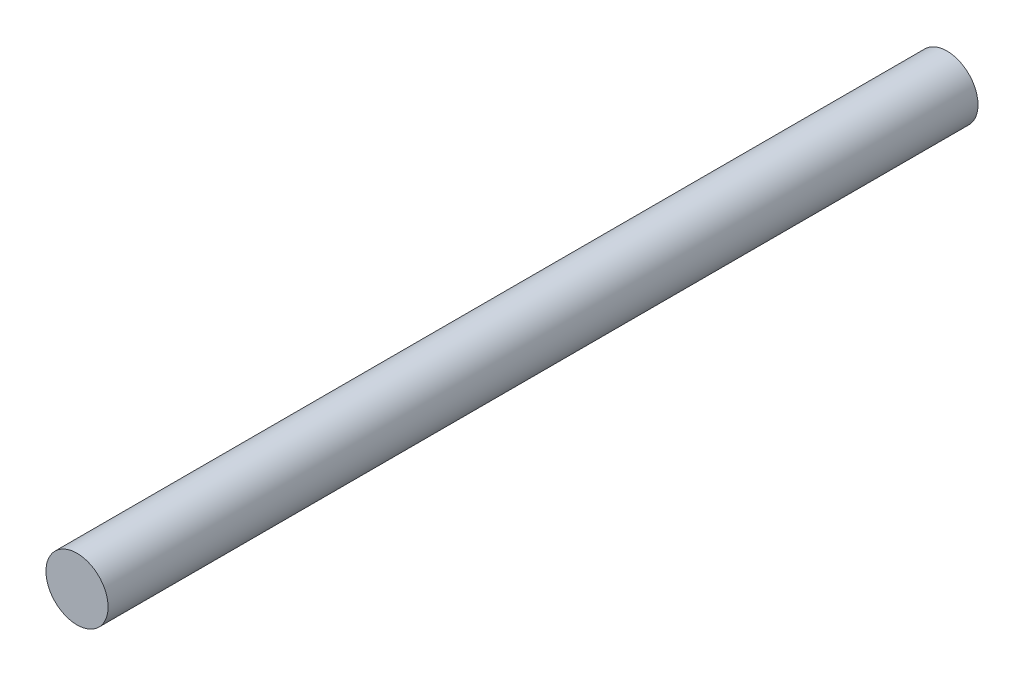
ISO-10303-21;
HEADER;
FILE_DESCRIPTION(('STEP AP214'),'2;1');
FILE_NAME('part.step','',(''),(''),'','','');
FILE_SCHEMA(('AUTOMOTIVE_DESIGN { 1 0 10303 214 1 1 1 1 }'));
ENDSEC;
DATA;
#1=APPLICATION_CONTEXT('core data for automotive mechanical design processes');
#2=APPLICATION_PROTOCOL_DEFINITION('international standard','automotive_design',2000,#1);
#3=PRODUCT_CONTEXT('',#1,'mechanical');
#4=PRODUCT('Part','Part','',(#3));
#5=PRODUCT_RELATED_PRODUCT_CATEGORY('part','',(#4));
#6=PRODUCT_DEFINITION_FORMATION('','',#4);
#7=PRODUCT_DEFINITION_CONTEXT('part definition',#1,'design');
#8=PRODUCT_DEFINITION('design','',#6,#7);
#9=PRODUCT_DEFINITION_SHAPE('','',#8);
#10=(LENGTH_UNIT() NAMED_UNIT(*) SI_UNIT(.MILLI.,.METRE.));
#11=(NAMED_UNIT(*) PLANE_ANGLE_UNIT() SI_UNIT($,.RADIAN.));
#12=(NAMED_UNIT(*) SI_UNIT($,.STERADIAN.) SOLID_ANGLE_UNIT());
#13=UNCERTAINTY_MEASURE_WITH_UNIT(LENGTH_MEASURE(1.E-05),#10,'distance_accuracy_value','');
#14=(GEOMETRIC_REPRESENTATION_CONTEXT(3) GLOBAL_UNCERTAINTY_ASSIGNED_CONTEXT((#13)) GLOBAL_UNIT_ASSIGNED_CONTEXT((#10,
#11,#12)) REPRESENTATION_CONTEXT('',''));
#15=CARTESIAN_POINT('',(0.,0.,0.));
#16=DIRECTION('',(0.,0.,1.));
#17=DIRECTION('',(1.,0.,0.));
#18=AXIS2_PLACEMENT_3D('',#15,#16,#17);
#19=CARTESIAN_POINT('',(0.,0.,70.));
#20=DIRECTION('',(0.,0.,-1.));
#21=DIRECTION('',(-1.,0.,0.));
#22=AXIS2_PLACEMENT_3D('',#19,#20,#21);
#23=CYLINDRICAL_SURFACE('',#22,2.5);
#24=CARTESIAN_POINT('',(0.,0.,70.));
#25=DIRECTION('',(0.,0.,1.));
#26=DIRECTION('',(1.,0.,0.));
#27=AXIS2_PLACEMENT_3D('',#24,#25,#26);
#28=CIRCLE('',#27,2.5);
#29=CARTESIAN_POINT('',(2.5,0.,70.));
#30=VERTEX_POINT('',#29);
#31=EDGE_CURVE('E10',#30,#30,#28,.T.);
#32=ORIENTED_EDGE('',*,*,#31,.F.);
#33=EDGE_LOOP('',(#32));
#34=FACE_BOUND('',#33,.T.);
#35=CARTESIAN_POINT('',(0.,0.,0.));
#36=DIRECTION('',(0.,0.,1.));
#37=DIRECTION('',(1.,0.,0.));
#38=AXIS2_PLACEMENT_3D('',#35,#36,#37);
#39=CIRCLE('',#38,2.5);
#40=CARTESIAN_POINT('',(2.5,0.,0.));
#41=VERTEX_POINT('',#40);
#42=EDGE_CURVE('E44',#41,#41,#39,.T.);
#43=ORIENTED_EDGE('',*,*,#42,.T.);
#44=EDGE_LOOP('',(#43));
#45=FACE_BOUND('',#44,.T.);
#46=ADVANCED_FACE('F41',(#34,#45),#23,.T.);
#47=CARTESIAN_POINT('',(0.,0.,70.));
#48=DIRECTION('',(0.,0.,1.));
#49=DIRECTION('',(1.,0.,0.));
#50=AXIS2_PLACEMENT_3D('',#47,#48,#49);
#51=PLANE('',#50);
#52=ORIENTED_EDGE('',*,*,#31,.T.);
#53=EDGE_LOOP('',(#52));
#54=FACE_BOUND('',#53,.T.);
#55=ADVANCED_FACE('F58',(#54),#51,.T.);
#56=CARTESIAN_POINT('',(0.,0.,0.));
#57=DIRECTION('',(0.,0.,1.));
#58=DIRECTION('',(1.,0.,0.));
#59=AXIS2_PLACEMENT_3D('',#56,#57,#58);
#60=PLANE('',#59);
#61=ORIENTED_EDGE('',*,*,#42,.F.);
#62=EDGE_LOOP('',(#61));
#63=FACE_BOUND('',#62,.T.);
#64=ADVANCED_FACE('F56',(#63),#60,.F.);
#65=CLOSED_SHELL('',(#46,#55,#64));
#66=MANIFOLD_SOLID_BREP('B2',#65);
#67=ADVANCED_BREP_SHAPE_REPRESENTATION('',(#18,#66),#14);
#68=SHAPE_DEFINITION_REPRESENTATION(#9,#67);
ENDSEC;
END-ISO-10303-21;
